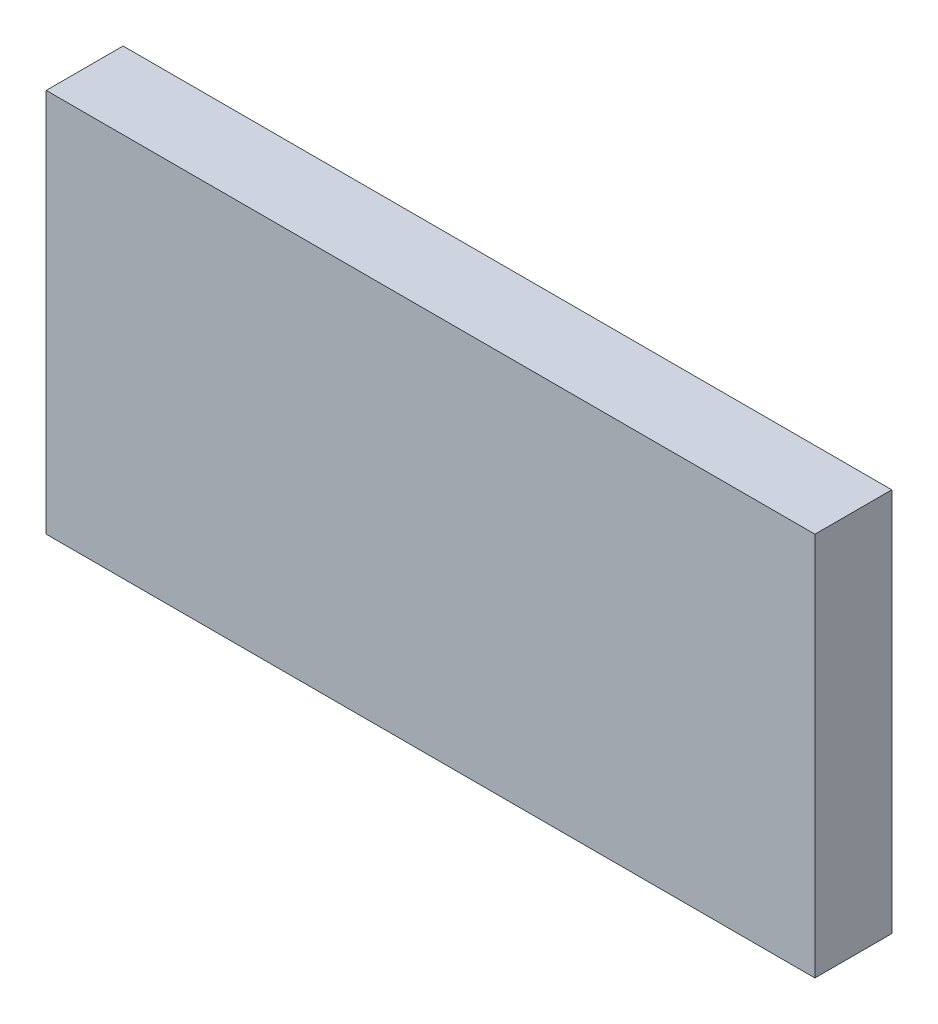
ISO-10303-21;
HEADER;
FILE_DESCRIPTION(('STEP AP214'),'2;1');
FILE_NAME('part.step','',(''),(''),'','','');
FILE_SCHEMA(('AUTOMOTIVE_DESIGN { 1 0 10303 214 1 1 1 1 }'));
ENDSEC;
DATA;
#1=APPLICATION_CONTEXT('core data for automotive mechanical design processes');
#2=APPLICATION_PROTOCOL_DEFINITION('international standard','automotive_design',2000,#1);
#3=PRODUCT_CONTEXT('',#1,'mechanical');
#4=PRODUCT('Part','Part','',(#3));
#5=PRODUCT_RELATED_PRODUCT_CATEGORY('part','',(#4));
#6=PRODUCT_DEFINITION_FORMATION('','',#4);
#7=PRODUCT_DEFINITION_CONTEXT('part definition',#1,'design');
#8=PRODUCT_DEFINITION('design','',#6,#7);
#9=PRODUCT_DEFINITION_SHAPE('','',#8);
#10=(LENGTH_UNIT() NAMED_UNIT(*) SI_UNIT(.MILLI.,.METRE.));
#11=(NAMED_UNIT(*) PLANE_ANGLE_UNIT() SI_UNIT($,.RADIAN.));
#12=(NAMED_UNIT(*) SI_UNIT($,.STERADIAN.) SOLID_ANGLE_UNIT());
#13=UNCERTAINTY_MEASURE_WITH_UNIT(LENGTH_MEASURE(1.E-05),#10,'distance_accuracy_value','');
#14=(GEOMETRIC_REPRESENTATION_CONTEXT(3) GLOBAL_UNCERTAINTY_ASSIGNED_CONTEXT((#13)) GLOBAL_UNIT_ASSIGNED_CONTEXT((#10,
#11,#12)) REPRESENTATION_CONTEXT('',''));
#15=CARTESIAN_POINT('',(0.,0.,0.));
#16=DIRECTION('',(0.,0.,1.));
#17=DIRECTION('',(1.,0.,0.));
#18=AXIS2_PLACEMENT_3D('',#15,#16,#17);
#19=CARTESIAN_POINT('',(49.9999999999999,-25.,10.));
#20=DIRECTION('',(-1.,0.,0.));
#21=DIRECTION('',(0.,0.,1.));
#22=AXIS2_PLACEMENT_3D('',#19,#20,#21);
#23=PLANE('',#22);
#24=DIRECTION('',(0.,1.,0.));
#25=VECTOR('',#24,1.);
#26=CARTESIAN_POINT('',(49.9999999999999,-25.,0.));
#27=LINE('',#26,#25);
#28=CARTESIAN_POINT('',(49.9999999999999,-25.,0.));
#29=VERTEX_POINT('',#28);
#30=CARTESIAN_POINT('',(49.9999999999999,25.,0.));
#31=VERTEX_POINT('',#30);
#32=EDGE_CURVE('E96',#29,#31,#27,.T.);
#33=ORIENTED_EDGE('',*,*,#32,.T.);
#34=DIRECTION('',(0.,0.,-1.));
#35=VECTOR('',#34,1.);
#36=CARTESIAN_POINT('',(49.9999999999999,25.,10.));
#37=LINE('',#36,#35);
#38=CARTESIAN_POINT('',(49.9999999999999,25.,10.));
#39=VERTEX_POINT('',#38);
#40=EDGE_CURVE('E11',#39,#31,#37,.T.);
#41=ORIENTED_EDGE('',*,*,#40,.F.);
#42=DIRECTION('',(0.,1.,0.));
#43=VECTOR('',#42,1.);
#44=CARTESIAN_POINT('',(49.9999999999999,-25.,10.));
#45=LINE('',#44,#43);
#46=CARTESIAN_POINT('',(49.9999999999999,-25.,10.));
#47=VERTEX_POINT('',#46);
#48=EDGE_CURVE('E84',#47,#39,#45,.T.);
#49=ORIENTED_EDGE('',*,*,#48,.F.);
#50=DIRECTION('',(0.,0.,-1.));
#51=VECTOR('',#50,1.);
#52=CARTESIAN_POINT('',(49.9999999999999,-25.,10.));
#53=LINE('',#52,#51);
#54=EDGE_CURVE('E92',#47,#29,#53,.T.);
#55=ORIENTED_EDGE('',*,*,#54,.T.);
#56=EDGE_LOOP('',(#33,#41,#49,#55));
#57=FACE_BOUND('',#56,.T.);
#58=ADVANCED_FACE('F33',(#57),#23,.F.);
#59=CARTESIAN_POINT('',(-50.0000000000001,25.,10.));
#60=DIRECTION('',(0.,-1.,0.));
#61=DIRECTION('',(0.,0.,-1.));
#62=AXIS2_PLACEMENT_3D('',#59,#60,#61);
#63=PLANE('',#62);
#64=DIRECTION('',(-1.,0.,0.));
#65=VECTOR('',#64,1.);
#66=CARTESIAN_POINT('',(-50.0000000000001,25.,0.));
#67=LINE('',#66,#65);
#68=CARTESIAN_POINT('',(-50.0000000000001,25.,0.));
#69=VERTEX_POINT('',#68);
#70=EDGE_CURVE('E88',#31,#69,#67,.T.);
#71=ORIENTED_EDGE('',*,*,#70,.T.);
#72=DIRECTION('',(0.,0.,-1.));
#73=VECTOR('',#72,1.);
#74=CARTESIAN_POINT('',(-50.0000000000001,25.,10.));
#75=LINE('',#74,#73);
#76=CARTESIAN_POINT('',(-50.0000000000001,25.,10.));
#77=VERTEX_POINT('',#76);
#78=EDGE_CURVE('E41',#77,#69,#75,.T.);
#79=ORIENTED_EDGE('',*,*,#78,.F.);
#80=DIRECTION('',(-1.,0.,0.));
#81=VECTOR('',#80,1.);
#82=CARTESIAN_POINT('',(-50.0000000000001,25.,10.));
#83=LINE('',#82,#81);
#84=EDGE_CURVE('E79',#39,#77,#83,.T.);
#85=ORIENTED_EDGE('',*,*,#84,.F.);
#86=ORIENTED_EDGE('',*,*,#40,.T.);
#87=EDGE_LOOP('',(#71,#79,#85,#86));
#88=FACE_BOUND('',#87,.T.);
#89=ADVANCED_FACE('F87',(#88),#63,.F.);
#90=CARTESIAN_POINT('',(-50.0000000000001,-25.,10.));
#91=DIRECTION('',(1.,0.,0.));
#92=DIRECTION('',(0.,0.,-1.));
#93=AXIS2_PLACEMENT_3D('',#90,#91,#92);
#94=PLANE('',#93);
#95=DIRECTION('',(0.,-1.,0.));
#96=VECTOR('',#95,1.);
#97=CARTESIAN_POINT('',(-50.0000000000001,-25.,0.));
#98=LINE('',#97,#96);
#99=CARTESIAN_POINT('',(-50.0000000000001,-25.,0.));
#100=VERTEX_POINT('',#99);
#101=EDGE_CURVE('E66',#69,#100,#98,.T.);
#102=ORIENTED_EDGE('',*,*,#101,.T.);
#103=DIRECTION('',(0.,0.,-1.));
#104=VECTOR('',#103,1.);
#105=CARTESIAN_POINT('',(-50.0000000000001,-25.,10.));
#106=LINE('',#105,#104);
#107=CARTESIAN_POINT('',(-50.0000000000001,-25.,10.));
#108=VERTEX_POINT('',#107);
#109=EDGE_CURVE('E89',#108,#100,#106,.T.);
#110=ORIENTED_EDGE('',*,*,#109,.F.);
#111=DIRECTION('',(0.,-1.,0.));
#112=VECTOR('',#111,1.);
#113=CARTESIAN_POINT('',(-50.0000000000001,-25.,10.));
#114=LINE('',#113,#112);
#115=EDGE_CURVE('E82',#77,#108,#114,.T.);
#116=ORIENTED_EDGE('',*,*,#115,.F.);
#117=ORIENTED_EDGE('',*,*,#78,.T.);
#118=EDGE_LOOP('',(#102,#110,#116,#117));
#119=FACE_BOUND('',#118,.T.);
#120=ADVANCED_FACE('F90',(#119),#94,.F.);
#121=CARTESIAN_POINT('',(-50.0000000000001,-25.,10.));
#122=DIRECTION('',(0.,1.,0.));
#123=DIRECTION('',(0.,0.,1.));
#124=AXIS2_PLACEMENT_3D('',#121,#122,#123);
#125=PLANE('',#124);
#126=DIRECTION('',(1.,0.,0.));
#127=VECTOR('',#126,1.);
#128=CARTESIAN_POINT('',(-50.0000000000001,-25.,0.));
#129=LINE('',#128,#127);
#130=EDGE_CURVE('E72',#100,#29,#129,.T.);
#131=ORIENTED_EDGE('',*,*,#130,.T.);
#132=ORIENTED_EDGE('',*,*,#54,.F.);
#133=DIRECTION('',(1.,0.,0.));
#134=VECTOR('',#133,1.);
#135=CARTESIAN_POINT('',(-50.0000000000001,-25.,10.));
#136=LINE('',#135,#134);
#137=EDGE_CURVE('E49',#108,#47,#136,.T.);
#138=ORIENTED_EDGE('',*,*,#137,.F.);
#139=ORIENTED_EDGE('',*,*,#109,.T.);
#140=EDGE_LOOP('',(#131,#132,#138,#139));
#141=FACE_BOUND('',#140,.T.);
#142=ADVANCED_FACE('F103',(#141),#125,.F.);
#143=CARTESIAN_POINT('',(0.,0.,10.));
#144=DIRECTION('',(0.,0.,-1.));
#145=DIRECTION('',(-1.,0.,0.));
#146=AXIS2_PLACEMENT_3D('',#143,#144,#145);
#147=PLANE('',#146);
#148=ORIENTED_EDGE('',*,*,#48,.T.);
#149=ORIENTED_EDGE('',*,*,#84,.T.);
#150=ORIENTED_EDGE('',*,*,#115,.T.);
#151=ORIENTED_EDGE('',*,*,#137,.T.);
#152=EDGE_LOOP('',(#148,#149,#150,#151));
#153=FACE_BOUND('',#152,.T.);
#154=ADVANCED_FACE('F80',(#153),#147,.F.);
#155=CARTESIAN_POINT('',(0.,0.,0.));
#156=DIRECTION('',(0.,0.,-1.));
#157=DIRECTION('',(-1.,0.,0.));
#158=AXIS2_PLACEMENT_3D('',#155,#156,#157);
#159=PLANE('',#158);
#160=ORIENTED_EDGE('',*,*,#32,.F.);
#161=ORIENTED_EDGE('',*,*,#130,.F.);
#162=ORIENTED_EDGE('',*,*,#101,.F.);
#163=ORIENTED_EDGE('',*,*,#70,.F.);
#164=EDGE_LOOP('',(#160,#161,#162,#163));
#165=FACE_BOUND('',#164,.T.);
#166=ADVANCED_FACE('F106',(#165),#159,.T.);
#167=CLOSED_SHELL('',(#58,#89,#120,#142,#154,#166));
#168=MANIFOLD_SOLID_BREP('B2',#167);
#169=ADVANCED_BREP_SHAPE_REPRESENTATION('',(#18,#168),#14);
#170=SHAPE_DEFINITION_REPRESENTATION(#9,#169);
ENDSEC;
END-ISO-10303-21;
